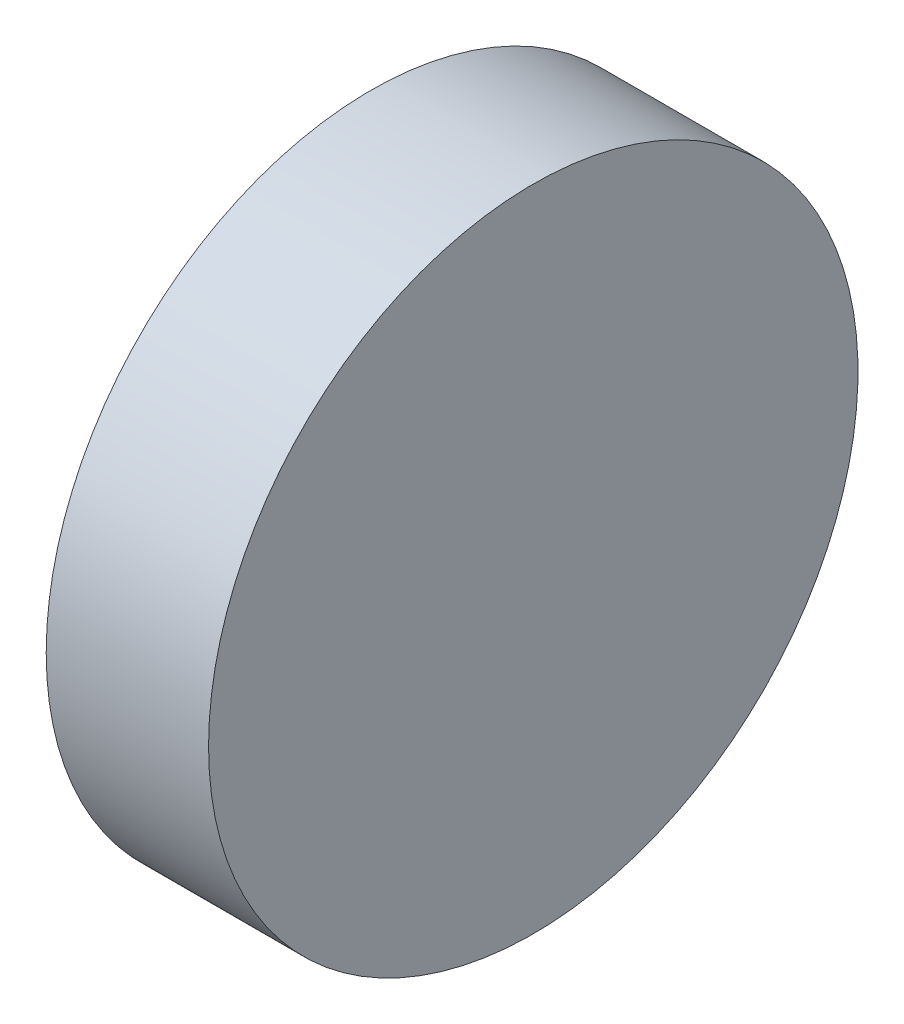
ISO-10303-21;
HEADER;
FILE_DESCRIPTION(('STEP AP214'),'2;1');
FILE_NAME('part.step','',(''),(''),'','','');
FILE_SCHEMA(('AUTOMOTIVE_DESIGN { 1 0 10303 214 1 1 1 1 }'));
ENDSEC;
DATA;
#1=APPLICATION_CONTEXT('core data for automotive mechanical design processes');
#2=APPLICATION_PROTOCOL_DEFINITION('international standard','automotive_design',2000,#1);
#3=PRODUCT_CONTEXT('',#1,'mechanical');
#4=PRODUCT('Part','Part','',(#3));
#5=PRODUCT_RELATED_PRODUCT_CATEGORY('part','',(#4));
#6=PRODUCT_DEFINITION_FORMATION('','',#4);
#7=PRODUCT_DEFINITION_CONTEXT('part definition',#1,'design');
#8=PRODUCT_DEFINITION('design','',#6,#7);
#9=PRODUCT_DEFINITION_SHAPE('','',#8);
#10=(LENGTH_UNIT() NAMED_UNIT(*) SI_UNIT(.MILLI.,.METRE.));
#11=(NAMED_UNIT(*) PLANE_ANGLE_UNIT() SI_UNIT($,.RADIAN.));
#12=(NAMED_UNIT(*) SI_UNIT($,.STERADIAN.) SOLID_ANGLE_UNIT());
#13=UNCERTAINTY_MEASURE_WITH_UNIT(LENGTH_MEASURE(1.E-05),#10,'distance_accuracy_value','');
#14=(GEOMETRIC_REPRESENTATION_CONTEXT(3) GLOBAL_UNCERTAINTY_ASSIGNED_CONTEXT((#13)) GLOBAL_UNIT_ASSIGNED_CONTEXT((#10,
#11,#12)) REPRESENTATION_CONTEXT('',''));
#15=CARTESIAN_POINT('',(0.,0.,0.));
#16=DIRECTION('',(0.,0.,1.));
#17=DIRECTION('',(1.,0.,0.));
#18=AXIS2_PLACEMENT_3D('',#15,#16,#17);
#19=CARTESIAN_POINT('',(0.,0.,0.));
#20=DIRECTION('',(-1.,0.,0.));
#21=DIRECTION('',(0.,0.,1.));
#22=AXIS2_PLACEMENT_3D('',#19,#20,#21);
#23=PLANE('',#22);
#24=CARTESIAN_POINT('',(0.,0.,0.));
#25=DIRECTION('',(-1.,0.,0.));
#26=DIRECTION('',(0.,0.,1.));
#27=AXIS2_PLACEMENT_3D('',#24,#25,#26);
#28=CIRCLE('',#27,12.7);
#29=CARTESIAN_POINT('',(0.,0.,12.7));
#30=VERTEX_POINT('',#29);
#31=EDGE_CURVE('E10',#30,#30,#28,.T.);
#32=ORIENTED_EDGE('',*,*,#31,.T.);
#33=EDGE_LOOP('',(#32));
#34=FACE_BOUND('',#33,.T.);
#35=ADVANCED_FACE('F33',(#34),#23,.T.);
#36=CARTESIAN_POINT('',(-5.44304994621531,0.,0.));
#37=DIRECTION('',(-1.,0.,0.));
#38=DIRECTION('',(0.,0.,1.));
#39=AXIS2_PLACEMENT_3D('',#36,#37,#38);
#40=CYLINDRICAL_SURFACE('',#39,12.7);
#41=CARTESIAN_POINT('',(6.35,0.,0.));
#42=DIRECTION('',(-1.,0.,0.));
#43=DIRECTION('',(0.,0.,1.));
#44=AXIS2_PLACEMENT_3D('',#41,#42,#43);
#45=CIRCLE('',#44,12.7);
#46=CARTESIAN_POINT('',(6.35,0.,12.7));
#47=VERTEX_POINT('',#46);
#48=EDGE_CURVE('E39',#47,#47,#45,.T.);
#49=ORIENTED_EDGE('',*,*,#48,.T.);
#50=EDGE_LOOP('',(#49));
#51=FACE_BOUND('',#50,.T.);
#52=ORIENTED_EDGE('',*,*,#31,.F.);
#53=EDGE_LOOP('',(#52));
#54=FACE_BOUND('',#53,.T.);
#55=ADVANCED_FACE('F45',(#51,#54),#40,.T.);
#56=CARTESIAN_POINT('',(6.35,0.,0.));
#57=DIRECTION('',(1.,0.,0.));
#58=DIRECTION('',(0.,0.,-1.));
#59=AXIS2_PLACEMENT_3D('',#56,#57,#58);
#60=PLANE('',#59);
#61=ORIENTED_EDGE('',*,*,#48,.F.);
#62=EDGE_LOOP('',(#61));
#63=FACE_BOUND('',#62,.T.);
#64=ADVANCED_FACE('F48',(#63),#60,.T.);
#65=CLOSED_SHELL('',(#35,#55,#64));
#66=MANIFOLD_SOLID_BREP('B2',#65);
#67=ADVANCED_BREP_SHAPE_REPRESENTATION('',(#18,#66),#14);
#68=SHAPE_DEFINITION_REPRESENTATION(#9,#67);
ENDSEC;
END-ISO-10303-21;
